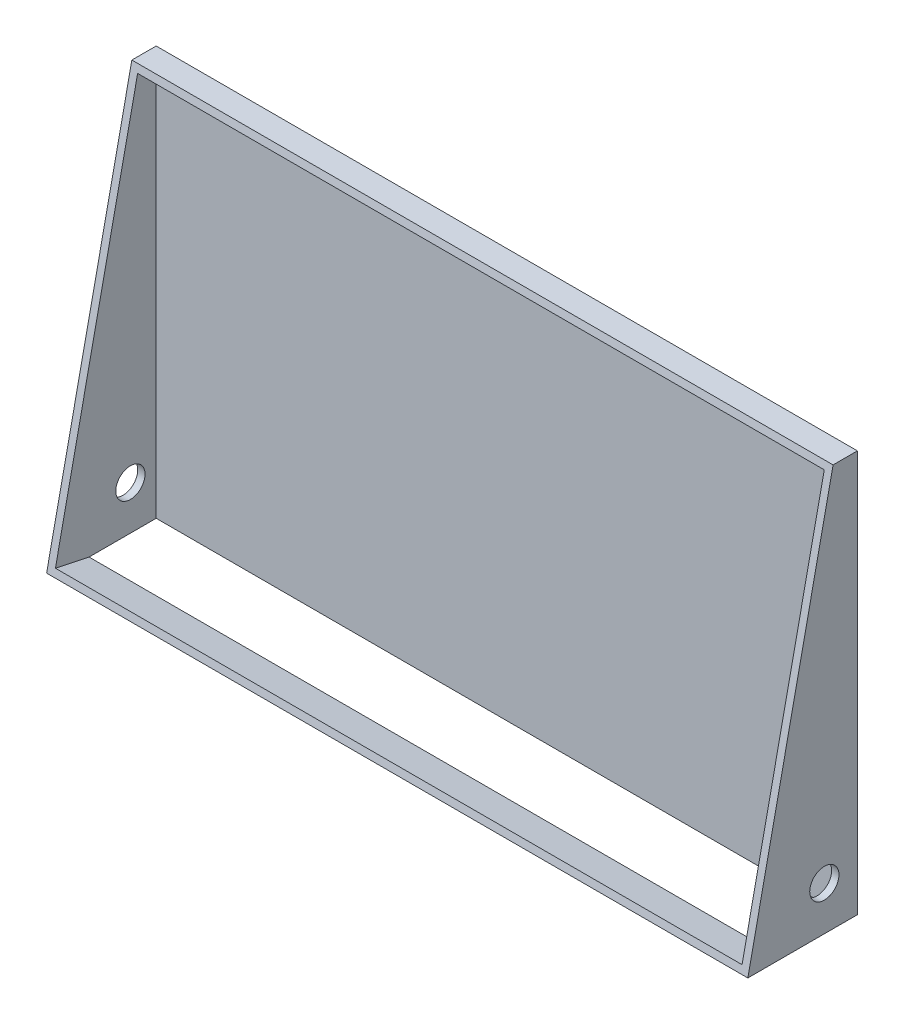
ISO-10303-21;
HEADER;
FILE_DESCRIPTION(('STEP AP214'),'2;1');
FILE_NAME('part.step','',(''),(''),'','','');
FILE_SCHEMA(('AUTOMOTIVE_DESIGN { 1 0 10303 214 1 1 1 1 }'));
ENDSEC;
DATA;
#1=APPLICATION_CONTEXT('core data for automotive mechanical design processes');
#2=APPLICATION_PROTOCOL_DEFINITION('international standard','automotive_design',2000,#1);
#3=PRODUCT_CONTEXT('',#1,'mechanical');
#4=PRODUCT('Part','Part','',(#3));
#5=PRODUCT_RELATED_PRODUCT_CATEGORY('part','',(#4));
#6=PRODUCT_DEFINITION_FORMATION('','',#4);
#7=PRODUCT_DEFINITION_CONTEXT('part definition',#1,'design');
#8=PRODUCT_DEFINITION('design','',#6,#7);
#9=PRODUCT_DEFINITION_SHAPE('','',#8);
#10=(LENGTH_UNIT() NAMED_UNIT(*) SI_UNIT(.MILLI.,.METRE.));
#11=(NAMED_UNIT(*) PLANE_ANGLE_UNIT() SI_UNIT($,.RADIAN.));
#12=(NAMED_UNIT(*) SI_UNIT($,.STERADIAN.) SOLID_ANGLE_UNIT());
#13=UNCERTAINTY_MEASURE_WITH_UNIT(LENGTH_MEASURE(1.E-05),#10,'distance_accuracy_value','');
#14=(GEOMETRIC_REPRESENTATION_CONTEXT(3) GLOBAL_UNCERTAINTY_ASSIGNED_CONTEXT((#13)) GLOBAL_UNIT_ASSIGNED_CONTEXT((#10,
#11,#12)) REPRESENTATION_CONTEXT('',''));
#15=CARTESIAN_POINT('',(0.,0.,0.));
#16=DIRECTION('',(0.,0.,1.));
#17=DIRECTION('',(1.,0.,0.));
#18=AXIS2_PLACEMENT_3D('',#15,#16,#17);
#19=CARTESIAN_POINT('',(-48.,-27.5,15.));
#20=DIRECTION('',(0.,1.,0.));
#21=DIRECTION('',(0.,0.,1.));
#22=AXIS2_PLACEMENT_3D('',#19,#20,#21);
#23=PLANE('',#22);
#24=DIRECTION('',(0.,0.,-1.));
#25=VECTOR('',#24,1.);
#26=CARTESIAN_POINT('',(47.,-27.5,15.));
#27=LINE('',#26,#25);
#28=CARTESIAN_POINT('',(47.,-27.5,10.1822025106137));
#29=VERTEX_POINT('',#28);
#30=CARTESIAN_POINT('',(47.,-27.5,0.999999999999987));
#31=VERTEX_POINT('',#30);
#32=EDGE_CURVE('E155',#29,#31,#27,.T.);
#33=ORIENTED_EDGE('',*,*,#32,.T.);
#34=DIRECTION('',(-1.,0.,0.));
#35=VECTOR('',#34,1.);
#36=CARTESIAN_POINT('',(-48.,-27.5,1.));
#37=LINE('',#36,#35);
#38=CARTESIAN_POINT('',(-47.,-27.5,1.));
#39=VERTEX_POINT('',#38);
#40=EDGE_CURVE('E12',#31,#39,#37,.T.);
#41=ORIENTED_EDGE('',*,*,#40,.T.);
#42=DIRECTION('',(0.,0.,1.));
#43=VECTOR('',#42,1.);
#44=CARTESIAN_POINT('',(-47.,-27.5,15.));
#45=LINE('',#44,#43);
#46=CARTESIAN_POINT('',(-47.,-27.5,10.1822025106135));
#47=VERTEX_POINT('',#46);
#48=EDGE_CURVE('E120',#39,#47,#45,.T.);
#49=ORIENTED_EDGE('',*,*,#48,.T.);
#50=DIRECTION('',(1.,0.,0.));
#51=VECTOR('',#50,1.);
#52=CARTESIAN_POINT('',(-48.,-27.5,10.1822025106135));
#53=LINE('',#52,#51);
#54=EDGE_CURVE('E159',#47,#29,#53,.T.);
#55=ORIENTED_EDGE('',*,*,#54,.T.);
#56=EDGE_LOOP('',(#33,#41,#49,#55));
#57=FACE_BOUND('',#56,.T.);
#58=DIRECTION('',(1.,0.,0.));
#59=VECTOR('',#58,1.);
#60=CARTESIAN_POINT('',(-48.,-27.5,0.));
#61=LINE('',#60,#59);
#62=CARTESIAN_POINT('',(-48.,-27.5,0.));
#63=VERTEX_POINT('',#62);
#64=CARTESIAN_POINT('',(48.,-27.5,0.));
#65=VERTEX_POINT('',#64);
#66=EDGE_CURVE('E175',#63,#65,#61,.T.);
#67=ORIENTED_EDGE('',*,*,#66,.T.);
#68=DIRECTION('',(0.,0.,-1.));
#69=VECTOR('',#68,1.);
#70=CARTESIAN_POINT('',(48.,-27.5,15.));
#71=LINE('',#70,#69);
#72=CARTESIAN_POINT('',(48.,-27.5,15.));
#73=VERTEX_POINT('',#72);
#74=EDGE_CURVE('E49',#73,#65,#71,.T.);
#75=ORIENTED_EDGE('',*,*,#74,.F.);
#76=DIRECTION('',(1.,0.,0.));
#77=VECTOR('',#76,1.);
#78=CARTESIAN_POINT('',(-48.,-27.5,15.));
#79=LINE('',#78,#77);
#80=CARTESIAN_POINT('',(-48.,-27.5,15.));
#81=VERTEX_POINT('',#80);
#82=EDGE_CURVE('E176',#81,#73,#79,.T.);
#83=ORIENTED_EDGE('',*,*,#82,.F.);
#84=DIRECTION('',(0.,0.,-1.));
#85=VECTOR('',#84,1.);
#86=CARTESIAN_POINT('',(-48.,-27.5,15.));
#87=LINE('',#86,#85);
#88=EDGE_CURVE('E179',#81,#63,#87,.T.);
#89=ORIENTED_EDGE('',*,*,#88,.T.);
#90=EDGE_LOOP('',(#67,#75,#83,#89));
#91=FACE_BOUND('',#90,.T.);
#92=ADVANCED_FACE('F40',(#57,#91),#23,.F.);
#93=CARTESIAN_POINT('',(48.,27.5,15.));
#94=DIRECTION('',(1.,0.,0.));
#95=DIRECTION('',(0.,1.,0.));
#96=AXIS2_PLACEMENT_3D('',#93,#94,#95);
#97=PLANE('',#96);
#98=CARTESIAN_POINT('',(48.,-21.5,4.52652095903879));
#99=DIRECTION('',(-1.,0.,0.));
#100=DIRECTION('',(0.,-1.,0.));
#101=AXIS2_PLACEMENT_3D('',#98,#99,#100);
#102=CIRCLE('',#101,2.);
#103=CARTESIAN_POINT('',(48.,-23.5,4.52652095903879));
#104=VERTEX_POINT('',#103);
#105=EDGE_CURVE('E261',#104,#104,#102,.T.);
#106=ORIENTED_EDGE('',*,*,#105,.T.);
#107=EDGE_LOOP('',(#106));
#108=FACE_BOUND('',#107,.T.);
#109=DIRECTION('',(0.,-0.978221498167757,0.207563726412946));
#110=VECTOR('',#109,1.);
#111=CARTESIAN_POINT('',(48.,27.5,3.32983636722908));
#112=LINE('',#111,#110);
#113=CARTESIAN_POINT('',(48.,27.5,3.32983636722908));
#114=VERTEX_POINT('',#113);
#115=EDGE_CURVE('E166',#114,#73,#112,.T.);
#116=ORIENTED_EDGE('',*,*,#115,.T.);
#117=ORIENTED_EDGE('',*,*,#74,.T.);
#118=DIRECTION('',(0.,-1.,0.));
#119=VECTOR('',#118,1.);
#120=CARTESIAN_POINT('',(48.,27.5,0.));
#121=LINE('',#120,#119);
#122=CARTESIAN_POINT('',(48.,27.5,0.));
#123=VERTEX_POINT('',#122);
#124=EDGE_CURVE('E184',#123,#65,#121,.T.);
#125=ORIENTED_EDGE('',*,*,#124,.F.);
#126=DIRECTION('',(0.,0.,-1.));
#127=VECTOR('',#126,1.);
#128=CARTESIAN_POINT('',(48.,27.5,15.));
#129=LINE('',#128,#127);
#130=EDGE_CURVE('E200',#114,#123,#129,.T.);
#131=ORIENTED_EDGE('',*,*,#130,.F.);
#132=EDGE_LOOP('',(#116,#117,#125,#131));
#133=FACE_BOUND('',#132,.T.);
#134=ADVANCED_FACE('F207',(#108,#133),#97,.T.);
#135=CARTESIAN_POINT('',(-48.,27.5,15.));
#136=DIRECTION('',(0.,1.,0.));
#137=DIRECTION('',(0.,0.,1.));
#138=AXIS2_PLACEMENT_3D('',#135,#136,#137);
#139=PLANE('',#138);
#140=DIRECTION('',(-1.,0.,0.));
#141=VECTOR('',#140,1.);
#142=CARTESIAN_POINT('',(48.,27.5,3.32983636722908));
#143=LINE('',#142,#141);
#144=CARTESIAN_POINT('',(-48.,27.5,3.32983636722908));
#145=VERTEX_POINT('',#144);
#146=EDGE_CURVE('E170',#114,#145,#143,.T.);
#147=ORIENTED_EDGE('',*,*,#146,.F.);
#148=ORIENTED_EDGE('',*,*,#130,.T.);
#149=DIRECTION('',(1.,0.,0.));
#150=VECTOR('',#149,1.);
#151=CARTESIAN_POINT('',(-48.,27.5,0.));
#152=LINE('',#151,#150);
#153=CARTESIAN_POINT('',(-48.,27.5,0.));
#154=VERTEX_POINT('',#153);
#155=EDGE_CURVE('E188',#154,#123,#152,.T.);
#156=ORIENTED_EDGE('',*,*,#155,.F.);
#157=DIRECTION('',(0.,0.,-1.));
#158=VECTOR('',#157,1.);
#159=CARTESIAN_POINT('',(-48.,27.5,15.));
#160=LINE('',#159,#158);
#161=EDGE_CURVE('E197',#145,#154,#160,.T.);
#162=ORIENTED_EDGE('',*,*,#161,.F.);
#163=EDGE_LOOP('',(#147,#148,#156,#162));
#164=FACE_BOUND('',#163,.T.);
#165=ADVANCED_FACE('F220',(#164),#139,.T.);
#166=CARTESIAN_POINT('',(-48.,27.5,15.));
#167=DIRECTION('',(1.,0.,0.));
#168=DIRECTION('',(0.,1.,0.));
#169=AXIS2_PLACEMENT_3D('',#166,#167,#168);
#170=PLANE('',#169);
#171=CARTESIAN_POINT('',(-48.,-21.5,4.52652095903879));
#172=DIRECTION('',(-1.,0.,0.));
#173=DIRECTION('',(0.,-1.,0.));
#174=AXIS2_PLACEMENT_3D('',#171,#172,#173);
#175=CIRCLE('',#174,2.);
#176=CARTESIAN_POINT('',(-48.,-23.5,4.52652095903879));
#177=VERTEX_POINT('',#176);
#178=EDGE_CURVE('E263',#177,#177,#175,.T.);
#179=ORIENTED_EDGE('',*,*,#178,.F.);
#180=EDGE_LOOP('',(#179));
#181=FACE_BOUND('',#180,.T.);
#182=ORIENTED_EDGE('',*,*,#88,.F.);
#183=DIRECTION('',(0.,-0.978221498167757,0.207563726412946));
#184=VECTOR('',#183,1.);
#185=CARTESIAN_POINT('',(-48.,27.5,3.32983636722908));
#186=LINE('',#185,#184);
#187=EDGE_CURVE('E165',#145,#81,#186,.T.);
#188=ORIENTED_EDGE('',*,*,#187,.F.);
#189=ORIENTED_EDGE('',*,*,#161,.T.);
#190=DIRECTION('',(0.,-1.,0.));
#191=VECTOR('',#190,1.);
#192=CARTESIAN_POINT('',(-48.,27.5,0.));
#193=LINE('',#192,#191);
#194=EDGE_CURVE('E180',#154,#63,#193,.T.);
#195=ORIENTED_EDGE('',*,*,#194,.T.);
#196=EDGE_LOOP('',(#182,#188,#189,#195));
#197=FACE_BOUND('',#196,.T.);
#198=ADVANCED_FACE('F225',(#181,#197),#170,.F.);
#199=CARTESIAN_POINT('',(0.,0.,0.));
#200=DIRECTION('',(0.,0.,-1.));
#201=DIRECTION('',(-1.,0.,0.));
#202=AXIS2_PLACEMENT_3D('',#199,#200,#201);
#203=PLANE('',#202);
#204=ORIENTED_EDGE('',*,*,#66,.F.);
#205=ORIENTED_EDGE('',*,*,#194,.F.);
#206=ORIENTED_EDGE('',*,*,#155,.T.);
#207=ORIENTED_EDGE('',*,*,#124,.T.);
#208=EDGE_LOOP('',(#204,#205,#206,#207));
#209=FACE_BOUND('',#208,.T.);
#210=ADVANCED_FACE('F215',(#209),#203,.T.);
#211=CARTESIAN_POINT('',(48.,27.5,3.32983636722908));
#212=DIRECTION('',(0.,-0.207563726412946,-0.978221498167757));
#213=DIRECTION('',(0.,0.978221498167757,-0.207563726412946));
#214=AXIS2_PLACEMENT_3D('',#211,#212,#213);
#215=PLANE('',#214);
#216=DIRECTION('',(0.,-0.978221498167757,0.207563726412946));
#217=VECTOR('',#216,1.);
#218=CARTESIAN_POINT('',(-47.,1.86087522688754,8.77006875819732));
#219=LINE('',#218,#217);
#220=CARTESIAN_POINT('',(-47.,26.5217785018323,3.53740009364202));
#221=VERTEX_POINT('',#220);
#222=CARTESIAN_POINT('',(-47.,-26.5217785018323,14.7924362735871));
#223=VERTEX_POINT('',#222);
#224=EDGE_CURVE('E139',#221,#223,#219,.T.);
#225=ORIENTED_EDGE('',*,*,#224,.F.);
#226=DIRECTION('',(-1.,0.,0.));
#227=VECTOR('',#226,1.);
#228=CARTESIAN_POINT('',(0.,26.5217785018323,3.53740009364203));
#229=LINE('',#228,#227);
#230=CARTESIAN_POINT('',(47.,26.5217785018323,3.53740009364202));
#231=VERTEX_POINT('',#230);
#232=EDGE_CURVE('E131',#231,#221,#229,.T.);
#233=ORIENTED_EDGE('',*,*,#232,.F.);
#234=DIRECTION('',(0.,0.978221498167757,-0.207563726412946));
#235=VECTOR('',#234,1.);
#236=CARTESIAN_POINT('',(47.,1.86087522688754,8.77006875819732));
#237=LINE('',#236,#235);
#238=CARTESIAN_POINT('',(47.,-26.5217785018323,14.7924362735871));
#239=VERTEX_POINT('',#238);
#240=EDGE_CURVE('E143',#239,#231,#237,.T.);
#241=ORIENTED_EDGE('',*,*,#240,.F.);
#242=DIRECTION('',(1.,0.,0.));
#243=VECTOR('',#242,1.);
#244=CARTESIAN_POINT('',(0.,-26.5217785018323,14.7924362735871));
#245=LINE('',#244,#243);
#246=EDGE_CURVE('E64',#223,#239,#245,.T.);
#247=ORIENTED_EDGE('',*,*,#246,.F.);
#248=EDGE_LOOP('',(#225,#233,#241,#247));
#249=FACE_BOUND('',#248,.T.);
#250=ORIENTED_EDGE('',*,*,#187,.T.);
#251=ORIENTED_EDGE('',*,*,#82,.T.);
#252=ORIENTED_EDGE('',*,*,#115,.F.);
#253=ORIENTED_EDGE('',*,*,#146,.T.);
#254=EDGE_LOOP('',(#250,#251,#252,#253));
#255=FACE_BOUND('',#254,.T.);
#256=ADVANCED_FACE('F223',(#249,#255),#215,.F.);
#257=CARTESIAN_POINT('',(0.,0.,1.));
#258=DIRECTION('',(0.,0.,-1.));
#259=DIRECTION('',(-1.,0.,0.));
#260=AXIS2_PLACEMENT_3D('',#257,#258,#259);
#261=PLANE('',#260);
#262=DIRECTION('',(0.,1.,0.));
#263=VECTOR('',#262,1.);
#264=CARTESIAN_POINT('',(47.,-22.8544287950639,1.));
#265=LINE('',#264,#263);
#266=CARTESIAN_POINT('',(47.,25.9833807873848,1.));
#267=VERTEX_POINT('',#266);
#268=EDGE_CURVE('E56',#31,#267,#265,.T.);
#269=ORIENTED_EDGE('',*,*,#268,.T.);
#270=DIRECTION('',(-1.,0.,0.));
#271=VECTOR('',#270,1.);
#272=CARTESIAN_POINT('',(0.,25.9833807873848,1.));
#273=LINE('',#272,#271);
#274=CARTESIAN_POINT('',(-47.,25.9833807873848,0.999999999999987));
#275=VERTEX_POINT('',#274);
#276=EDGE_CURVE('E129',#267,#275,#273,.T.);
#277=ORIENTED_EDGE('',*,*,#276,.T.);
#278=DIRECTION('',(0.,-1.,0.));
#279=VECTOR('',#278,1.);
#280=CARTESIAN_POINT('',(-47.,-22.8544287950639,1.));
#281=LINE('',#280,#279);
#282=EDGE_CURVE('E112',#275,#39,#281,.T.);
#283=ORIENTED_EDGE('',*,*,#282,.T.);
#284=ORIENTED_EDGE('',*,*,#40,.F.);
#285=EDGE_LOOP('',(#269,#277,#283,#284));
#286=FACE_BOUND('',#285,.T.);
#287=ADVANCED_FACE('F135',(#286),#261,.F.);
#288=CARTESIAN_POINT('',(-47.,-22.8544287950639,-107.710022179874));
#289=DIRECTION('',(-1.,0.,0.));
#290=DIRECTION('',(0.,0.,1.));
#291=AXIS2_PLACEMENT_3D('',#288,#289,#290);
#292=PLANE('',#291);
#293=CARTESIAN_POINT('',(-47.,-21.5,4.52652095903879));
#294=DIRECTION('',(-1.,0.,0.));
#295=DIRECTION('',(0.,0.,1.));
#296=AXIS2_PLACEMENT_3D('',#293,#294,#295);
#297=CIRCLE('',#296,2.);
#298=CARTESIAN_POINT('',(-47.,-21.5,6.52652095903879));
#299=VERTEX_POINT('',#298);
#300=EDGE_CURVE('E252',#299,#299,#297,.T.);
#301=ORIENTED_EDGE('',*,*,#300,.T.);
#302=EDGE_LOOP('',(#301));
#303=FACE_BOUND('',#302,.T.);
#304=ORIENTED_EDGE('',*,*,#282,.F.);
#305=DIRECTION('',(0.,0.207563726412946,0.978221498167757));
#306=VECTOR('',#305,1.);
#307=CARTESIAN_POINT('',(-47.,1.80647447988079,-112.942690844429));
#308=LINE('',#307,#306);
#309=EDGE_CURVE('E116',#275,#221,#308,.T.);
#310=ORIENTED_EDGE('',*,*,#309,.T.);
#311=ORIENTED_EDGE('',*,*,#224,.T.);
#312=DIRECTION('',(0.,0.207563726412946,0.978221498167757));
#313=VECTOR('',#312,1.);
#314=CARTESIAN_POINT('',(-47.,-51.2370825237837,-101.687654664484));
#315=LINE('',#314,#313);
#316=EDGE_CURVE('E124',#47,#223,#315,.T.);
#317=ORIENTED_EDGE('',*,*,#316,.F.);
#318=ORIENTED_EDGE('',*,*,#48,.F.);
#319=EDGE_LOOP('',(#304,#310,#311,#317,#318));
#320=FACE_BOUND('',#319,.T.);
#321=ADVANCED_FACE('F114',(#303,#320),#292,.F.);
#322=CARTESIAN_POINT('',(0.,-51.2370825237837,-101.687654664484));
#323=DIRECTION('',(0.,-0.978221498167757,0.207563726412946));
#324=DIRECTION('',(0.,-0.207563726412946,-0.978221498167757));
#325=AXIS2_PLACEMENT_3D('',#322,#323,#324);
#326=PLANE('',#325);
#327=ORIENTED_EDGE('',*,*,#316,.T.);
#328=ORIENTED_EDGE('',*,*,#246,.T.);
#329=DIRECTION('',(0.,0.207563726412946,0.978221498167757));
#330=VECTOR('',#329,1.);
#331=CARTESIAN_POINT('',(47.,-51.2370825237837,-101.687654664484));
#332=LINE('',#331,#330);
#333=EDGE_CURVE('E147',#29,#239,#332,.T.);
#334=ORIENTED_EDGE('',*,*,#333,.F.);
#335=ORIENTED_EDGE('',*,*,#54,.F.);
#336=EDGE_LOOP('',(#327,#328,#334,#335));
#337=FACE_BOUND('',#336,.T.);
#338=ADVANCED_FACE('F247',(#337),#326,.F.);
#339=CARTESIAN_POINT('',(47.,-22.8544287950639,-107.710022179874));
#340=DIRECTION('',(1.,0.,0.));
#341=DIRECTION('',(0.,0.,-1.));
#342=AXIS2_PLACEMENT_3D('',#339,#340,#341);
#343=PLANE('',#342);
#344=CARTESIAN_POINT('',(47.,-21.5,4.52652095903879));
#345=DIRECTION('',(1.,0.,0.));
#346=DIRECTION('',(0.,0.,-1.));
#347=AXIS2_PLACEMENT_3D('',#344,#345,#346);
#348=CIRCLE('',#347,2.);
#349=CARTESIAN_POINT('',(47.,-21.5,2.52652095903879));
#350=VERTEX_POINT('',#349);
#351=EDGE_CURVE('E43',#350,#350,#348,.T.);
#352=ORIENTED_EDGE('',*,*,#351,.T.);
#353=EDGE_LOOP('',(#352));
#354=FACE_BOUND('',#353,.T.);
#355=ORIENTED_EDGE('',*,*,#333,.T.);
#356=ORIENTED_EDGE('',*,*,#240,.T.);
#357=DIRECTION('',(0.,0.207563726412946,0.978221498167757));
#358=VECTOR('',#357,1.);
#359=CARTESIAN_POINT('',(47.,1.80647447988079,-112.942690844429));
#360=LINE('',#359,#358);
#361=EDGE_CURVE('E146',#267,#231,#360,.T.);
#362=ORIENTED_EDGE('',*,*,#361,.F.);
#363=ORIENTED_EDGE('',*,*,#268,.F.);
#364=ORIENTED_EDGE('',*,*,#32,.F.);
#365=EDGE_LOOP('',(#355,#356,#362,#363,#364));
#366=FACE_BOUND('',#365,.T.);
#367=ADVANCED_FACE('F244',(#354,#366),#343,.F.);
#368=CARTESIAN_POINT('',(0.,1.80647447988079,-112.942690844429));
#369=DIRECTION('',(0.,0.978221498167757,-0.207563726412946));
#370=DIRECTION('',(0.,0.207563726412946,0.978221498167757));
#371=AXIS2_PLACEMENT_3D('',#368,#369,#370);
#372=PLANE('',#371);
#373=ORIENTED_EDGE('',*,*,#361,.T.);
#374=ORIENTED_EDGE('',*,*,#232,.T.);
#375=ORIENTED_EDGE('',*,*,#309,.F.);
#376=ORIENTED_EDGE('',*,*,#276,.F.);
#377=EDGE_LOOP('',(#373,#374,#375,#376));
#378=FACE_BOUND('',#377,.T.);
#379=ADVANCED_FACE('F128',(#378),#372,.F.);
#380=CARTESIAN_POINT('',(48.,-21.5,4.52652095903879));
#381=DIRECTION('',(-1.,0.,0.));
#382=DIRECTION('',(0.,-1.,0.));
#383=AXIS2_PLACEMENT_3D('',#380,#381,#382);
#384=CYLINDRICAL_SURFACE('',#383,2.);
#385=ORIENTED_EDGE('',*,*,#105,.F.);
#386=EDGE_LOOP('',(#385));
#387=FACE_BOUND('',#386,.T.);
#388=ORIENTED_EDGE('',*,*,#351,.F.);
#389=EDGE_LOOP('',(#388));
#390=FACE_BOUND('',#389,.T.);
#391=ADVANCED_FACE('F271',(#387,#390),#384,.F.);
#392=ORIENTED_EDGE('',*,*,#178,.T.);
#393=EDGE_LOOP('',(#392));
#394=FACE_BOUND('',#393,.T.);
#395=ORIENTED_EDGE('',*,*,#300,.F.);
#396=EDGE_LOOP('',(#395));
#397=FACE_BOUND('',#396,.T.);
#398=ADVANCED_FACE('F274',(#394,#397),#384,.F.);
#399=CLOSED_SHELL('',(#92,#134,#165,#198,#210,#256,#287,#321,#338,#367,#379,#391,#398));
#400=MANIFOLD_SOLID_BREP('B2',#399);
#401=ADVANCED_BREP_SHAPE_REPRESENTATION('',(#18,#400),#14);
#402=SHAPE_DEFINITION_REPRESENTATION(#9,#401);
ENDSEC;
END-ISO-10303-21;
